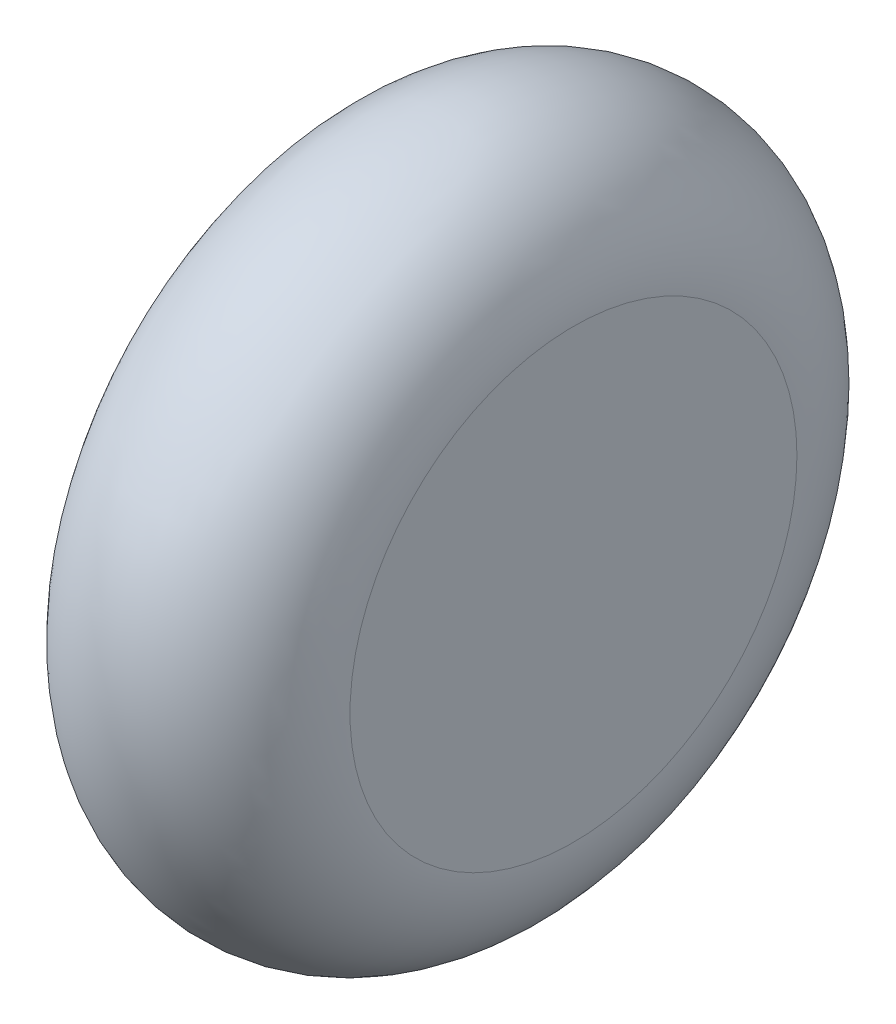
ISO-10303-21;
HEADER;
FILE_DESCRIPTION(('STEP AP214'),'2;1');
FILE_NAME('part.step','',(''),(''),'','','');
FILE_SCHEMA(('AUTOMOTIVE_DESIGN { 1 0 10303 214 1 1 1 1 }'));
ENDSEC;
DATA;
#1=APPLICATION_CONTEXT('core data for automotive mechanical design processes');
#2=APPLICATION_PROTOCOL_DEFINITION('international standard','automotive_design',2000,#1);
#3=PRODUCT_CONTEXT('',#1,'mechanical');
#4=PRODUCT('Part','Part','',(#3));
#5=PRODUCT_RELATED_PRODUCT_CATEGORY('part','',(#4));
#6=PRODUCT_DEFINITION_FORMATION('','',#4);
#7=PRODUCT_DEFINITION_CONTEXT('part definition',#1,'design');
#8=PRODUCT_DEFINITION('design','',#6,#7);
#9=PRODUCT_DEFINITION_SHAPE('','',#8);
#10=(LENGTH_UNIT() NAMED_UNIT(*) SI_UNIT(.MILLI.,.METRE.));
#11=(NAMED_UNIT(*) PLANE_ANGLE_UNIT() SI_UNIT($,.RADIAN.));
#12=(NAMED_UNIT(*) SI_UNIT($,.STERADIAN.) SOLID_ANGLE_UNIT());
#13=UNCERTAINTY_MEASURE_WITH_UNIT(LENGTH_MEASURE(1.E-05),#10,'distance_accuracy_value','');
#14=(GEOMETRIC_REPRESENTATION_CONTEXT(3) GLOBAL_UNCERTAINTY_ASSIGNED_CONTEXT((#13)) GLOBAL_UNIT_ASSIGNED_CONTEXT((#10,
#11,#12)) REPRESENTATION_CONTEXT('',''));
#15=CARTESIAN_POINT('',(0.,0.,0.));
#16=DIRECTION('',(0.,0.,1.));
#17=DIRECTION('',(1.,0.,0.));
#18=AXIS2_PLACEMENT_3D('',#15,#16,#17);
#19=CARTESIAN_POINT('',(0.,0.,0.));
#20=DIRECTION('',(1.,0.,0.));
#21=DIRECTION('',(0.,0.,-1.));
#22=AXIS2_PLACEMENT_3D('',#19,#20,#21);
#23=TOROIDAL_SURFACE('',#22,8.128,4.572);
#24=CARTESIAN_POINT('',(4.572,0.,0.));
#25=DIRECTION('',(1.,0.,0.));
#26=DIRECTION('',(0.,0.,-1.));
#27=AXIS2_PLACEMENT_3D('',#24,#25,#26);
#28=CIRCLE('',#27,8.128);
#29=CARTESIAN_POINT('',(4.572,0.,-8.128));
#30=VERTEX_POINT('',#29);
#31=EDGE_CURVE('E46',#30,#30,#28,.T.);
#32=ORIENTED_EDGE('',*,*,#31,.F.);
#33=EDGE_LOOP('',(#32));
#34=FACE_BOUND('',#33,.T.);
#35=CARTESIAN_POINT('',(-4.572,0.,0.));
#36=DIRECTION('',(1.,0.,0.));
#37=DIRECTION('',(0.,0.,-1.));
#38=AXIS2_PLACEMENT_3D('',#35,#36,#37);
#39=CIRCLE('',#38,8.128);
#40=CARTESIAN_POINT('',(-4.572,0.,-8.128));
#41=VERTEX_POINT('',#40);
#42=EDGE_CURVE('E10',#41,#41,#39,.F.);
#43=ORIENTED_EDGE('',*,*,#42,.F.);
#44=EDGE_LOOP('',(#43));
#45=FACE_BOUND('',#44,.T.);
#46=ADVANCED_FACE('F40',(#34,#45),#23,.T.);
#47=CARTESIAN_POINT('',(4.572,0.,0.));
#48=DIRECTION('',(1.,0.,0.));
#49=DIRECTION('',(0.,0.,-1.));
#50=AXIS2_PLACEMENT_3D('',#47,#48,#49);
#51=PLANE('',#50);
#52=ORIENTED_EDGE('',*,*,#31,.T.);
#53=EDGE_LOOP('',(#52));
#54=FACE_BOUND('',#53,.T.);
#55=ADVANCED_FACE('F52',(#54),#51,.T.);
#56=CARTESIAN_POINT('',(-4.572,0.,0.));
#57=DIRECTION('',(1.,0.,0.));
#58=DIRECTION('',(0.,0.,-1.));
#59=AXIS2_PLACEMENT_3D('',#56,#57,#58);
#60=PLANE('',#59);
#61=ORIENTED_EDGE('',*,*,#42,.T.);
#62=EDGE_LOOP('',(#61));
#63=FACE_BOUND('',#62,.T.);
#64=ADVANCED_FACE('F59',(#63),#60,.F.);
#65=CLOSED_SHELL('',(#46,#55,#64));
#66=MANIFOLD_SOLID_BREP('B2',#65);
#67=ADVANCED_BREP_SHAPE_REPRESENTATION('',(#18,#66),#14);
#68=SHAPE_DEFINITION_REPRESENTATION(#9,#67);
ENDSEC;
END-ISO-10303-21;
